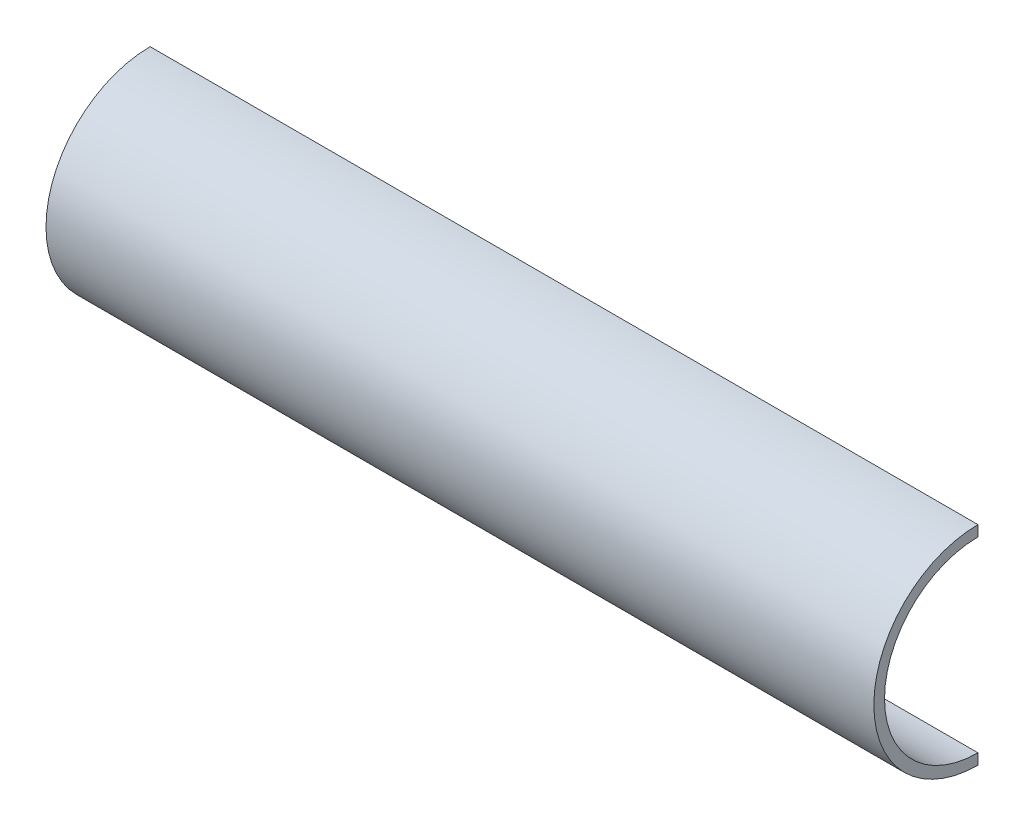
ISO-10303-21;
HEADER;
FILE_DESCRIPTION(('STEP AP214'),'2;1');
FILE_NAME('part.step','',(''),(''),'','','');
FILE_SCHEMA(('AUTOMOTIVE_DESIGN { 1 0 10303 214 1 1 1 1 }'));
ENDSEC;
DATA;
#1=APPLICATION_CONTEXT('core data for automotive mechanical design processes');
#2=APPLICATION_PROTOCOL_DEFINITION('international standard','automotive_design',2000,#1);
#3=PRODUCT_CONTEXT('',#1,'mechanical');
#4=PRODUCT('Part','Part','',(#3));
#5=PRODUCT_RELATED_PRODUCT_CATEGORY('part','',(#4));
#6=PRODUCT_DEFINITION_FORMATION('','',#4);
#7=PRODUCT_DEFINITION_CONTEXT('part definition',#1,'design');
#8=PRODUCT_DEFINITION('design','',#6,#7);
#9=PRODUCT_DEFINITION_SHAPE('','',#8);
#10=(LENGTH_UNIT() NAMED_UNIT(*) SI_UNIT(.MILLI.,.METRE.));
#11=(NAMED_UNIT(*) PLANE_ANGLE_UNIT() SI_UNIT($,.RADIAN.));
#12=(NAMED_UNIT(*) SI_UNIT($,.STERADIAN.) SOLID_ANGLE_UNIT());
#13=UNCERTAINTY_MEASURE_WITH_UNIT(LENGTH_MEASURE(1.E-05),#10,'distance_accuracy_value','');
#14=(GEOMETRIC_REPRESENTATION_CONTEXT(3) GLOBAL_UNCERTAINTY_ASSIGNED_CONTEXT((#13)) GLOBAL_UNIT_ASSIGNED_CONTEXT((#10,
#11,#12)) REPRESENTATION_CONTEXT('',''));
#15=CARTESIAN_POINT('',(0.,0.,0.));
#16=DIRECTION('',(0.,0.,1.));
#17=DIRECTION('',(1.,0.,0.));
#18=AXIS2_PLACEMENT_3D('',#15,#16,#17);
#19=CARTESIAN_POINT('',(310.,0.,0.));
#20=DIRECTION('',(0.,0.,1.));
#21=DIRECTION('',(1.,0.,0.));
#22=AXIS2_PLACEMENT_3D('',#19,#20,#21);
#23=PLANE('',#22);
#24=DIRECTION('',(0.,1.,0.));
#25=VECTOR('',#24,1.);
#26=CARTESIAN_POINT('',(0.,0.,0.));
#27=LINE('',#26,#25);
#28=CARTESIAN_POINT('',(0.,35.,0.));
#29=VERTEX_POINT('',#28);
#30=CARTESIAN_POINT('',(0.,39.,0.));
#31=VERTEX_POINT('',#30);
#32=EDGE_CURVE('E105',#29,#31,#27,.T.);
#33=ORIENTED_EDGE('',*,*,#32,.T.);
#34=DIRECTION('',(-1.,0.,0.));
#35=VECTOR('',#34,1.);
#36=CARTESIAN_POINT('',(310.,39.,0.));
#37=LINE('',#36,#35);
#38=CARTESIAN_POINT('',(310.,39.,0.));
#39=VERTEX_POINT('',#38);
#40=EDGE_CURVE('E11',#39,#31,#37,.T.);
#41=ORIENTED_EDGE('',*,*,#40,.F.);
#42=DIRECTION('',(0.,1.,0.));
#43=VECTOR('',#42,1.);
#44=CARTESIAN_POINT('',(310.,0.,0.));
#45=LINE('',#44,#43);
#46=CARTESIAN_POINT('',(310.,35.,0.));
#47=VERTEX_POINT('',#46);
#48=EDGE_CURVE('E88',#47,#39,#45,.T.);
#49=ORIENTED_EDGE('',*,*,#48,.F.);
#50=DIRECTION('',(-1.,0.,0.));
#51=VECTOR('',#50,1.);
#52=CARTESIAN_POINT('',(310.,35.,0.));
#53=LINE('',#52,#51);
#54=EDGE_CURVE('E55',#47,#29,#53,.T.);
#55=ORIENTED_EDGE('',*,*,#54,.T.);
#56=EDGE_LOOP('',(#33,#41,#49,#55));
#57=FACE_BOUND('',#56,.T.);
#58=ADVANCED_FACE('F38',(#57),#23,.F.);
#59=CARTESIAN_POINT('',(310.,0.,0.));
#60=DIRECTION('',(-1.,0.,0.));
#61=DIRECTION('',(0.,0.,1.));
#62=AXIS2_PLACEMENT_3D('',#59,#60,#61);
#63=CYLINDRICAL_SURFACE('',#62,39.);
#64=CARTESIAN_POINT('',(0.,0.,0.));
#65=DIRECTION('',(1.,0.,0.));
#66=DIRECTION('',(0.,0.,-1.));
#67=AXIS2_PLACEMENT_3D('',#64,#65,#66);
#68=CIRCLE('',#67,39.);
#69=CARTESIAN_POINT('',(0.,-39.,0.));
#70=VERTEX_POINT('',#69);
#71=EDGE_CURVE('E92',#31,#70,#68,.T.);
#72=ORIENTED_EDGE('',*,*,#71,.T.);
#73=DIRECTION('',(-1.,0.,0.));
#74=VECTOR('',#73,1.);
#75=CARTESIAN_POINT('',(310.,-39.,0.));
#76=LINE('',#75,#74);
#77=CARTESIAN_POINT('',(310.,-39.,0.));
#78=VERTEX_POINT('',#77);
#79=EDGE_CURVE('E47',#78,#70,#76,.T.);
#80=ORIENTED_EDGE('',*,*,#79,.F.);
#81=CARTESIAN_POINT('',(310.,0.,0.));
#82=DIRECTION('',(1.,0.,0.));
#83=DIRECTION('',(0.,0.,-1.));
#84=AXIS2_PLACEMENT_3D('',#81,#82,#83);
#85=CIRCLE('',#84,39.);
#86=EDGE_CURVE('E81',#39,#78,#85,.T.);
#87=ORIENTED_EDGE('',*,*,#86,.F.);
#88=ORIENTED_EDGE('',*,*,#40,.T.);
#89=EDGE_LOOP('',(#72,#80,#87,#88));
#90=FACE_BOUND('',#89,.T.);
#91=ADVANCED_FACE('F40',(#90),#63,.T.);
#92=CARTESIAN_POINT('',(0.,-35.,0.));
#93=VERTEX_POINT('',#92);
#94=EDGE_CURVE('E101',#70,#93,#27,.T.);
#95=ORIENTED_EDGE('',*,*,#94,.T.);
#96=DIRECTION('',(-1.,0.,0.));
#97=VECTOR('',#96,1.);
#98=CARTESIAN_POINT('',(310.,-35.,0.));
#99=LINE('',#98,#97);
#100=CARTESIAN_POINT('',(310.,-35.,0.));
#101=VERTEX_POINT('',#100);
#102=EDGE_CURVE('E70',#101,#93,#99,.T.);
#103=ORIENTED_EDGE('',*,*,#102,.F.);
#104=EDGE_CURVE('E87',#78,#101,#45,.T.);
#105=ORIENTED_EDGE('',*,*,#104,.F.);
#106=ORIENTED_EDGE('',*,*,#79,.T.);
#107=EDGE_LOOP('',(#95,#103,#105,#106));
#108=FACE_BOUND('',#107,.T.);
#109=ADVANCED_FACE('F95',(#108),#23,.F.);
#110=CARTESIAN_POINT('',(310.,0.,0.));
#111=DIRECTION('',(-1.,0.,0.));
#112=DIRECTION('',(0.,0.,1.));
#113=AXIS2_PLACEMENT_3D('',#110,#111,#112);
#114=CYLINDRICAL_SURFACE('',#113,35.);
#115=CARTESIAN_POINT('',(0.,0.,0.));
#116=DIRECTION('',(1.,0.,0.));
#117=DIRECTION('',(0.,0.,-1.));
#118=AXIS2_PLACEMENT_3D('',#115,#116,#117);
#119=CIRCLE('',#118,35.);
#120=EDGE_CURVE('E99',#29,#93,#119,.T.);
#121=ORIENTED_EDGE('',*,*,#120,.F.);
#122=ORIENTED_EDGE('',*,*,#54,.F.);
#123=CARTESIAN_POINT('',(310.,0.,0.));
#124=DIRECTION('',(1.,0.,0.));
#125=DIRECTION('',(0.,0.,-1.));
#126=AXIS2_PLACEMENT_3D('',#123,#124,#125);
#127=CIRCLE('',#126,35.);
#128=EDGE_CURVE('E96',#47,#101,#127,.T.);
#129=ORIENTED_EDGE('',*,*,#128,.T.);
#130=ORIENTED_EDGE('',*,*,#102,.T.);
#131=EDGE_LOOP('',(#121,#122,#129,#130));
#132=FACE_BOUND('',#131,.T.);
#133=ADVANCED_FACE('F110',(#132),#114,.F.);
#134=CARTESIAN_POINT('',(310.,0.,0.));
#135=DIRECTION('',(1.,0.,0.));
#136=DIRECTION('',(0.,0.,-1.));
#137=AXIS2_PLACEMENT_3D('',#134,#135,#136);
#138=PLANE('',#137);
#139=ORIENTED_EDGE('',*,*,#48,.T.);
#140=ORIENTED_EDGE('',*,*,#86,.T.);
#141=ORIENTED_EDGE('',*,*,#104,.T.);
#142=ORIENTED_EDGE('',*,*,#128,.F.);
#143=EDGE_LOOP('',(#139,#140,#141,#142));
#144=FACE_BOUND('',#143,.T.);
#145=ADVANCED_FACE('F84',(#144),#138,.T.);
#146=CARTESIAN_POINT('',(0.,0.,0.));
#147=DIRECTION('',(1.,0.,0.));
#148=DIRECTION('',(0.,0.,-1.));
#149=AXIS2_PLACEMENT_3D('',#146,#147,#148);
#150=PLANE('',#149);
#151=ORIENTED_EDGE('',*,*,#32,.F.);
#152=ORIENTED_EDGE('',*,*,#120,.T.);
#153=ORIENTED_EDGE('',*,*,#94,.F.);
#154=ORIENTED_EDGE('',*,*,#71,.F.);
#155=EDGE_LOOP('',(#151,#152,#153,#154));
#156=FACE_BOUND('',#155,.T.);
#157=ADVANCED_FACE('F109',(#156),#150,.F.);
#158=CLOSED_SHELL('',(#58,#91,#109,#133,#145,#157));
#159=MANIFOLD_SOLID_BREP('B2',#158);
#160=ADVANCED_BREP_SHAPE_REPRESENTATION('',(#18,#159),#14);
#161=SHAPE_DEFINITION_REPRESENTATION(#9,#160);
ENDSEC;
END-ISO-10303-21;
